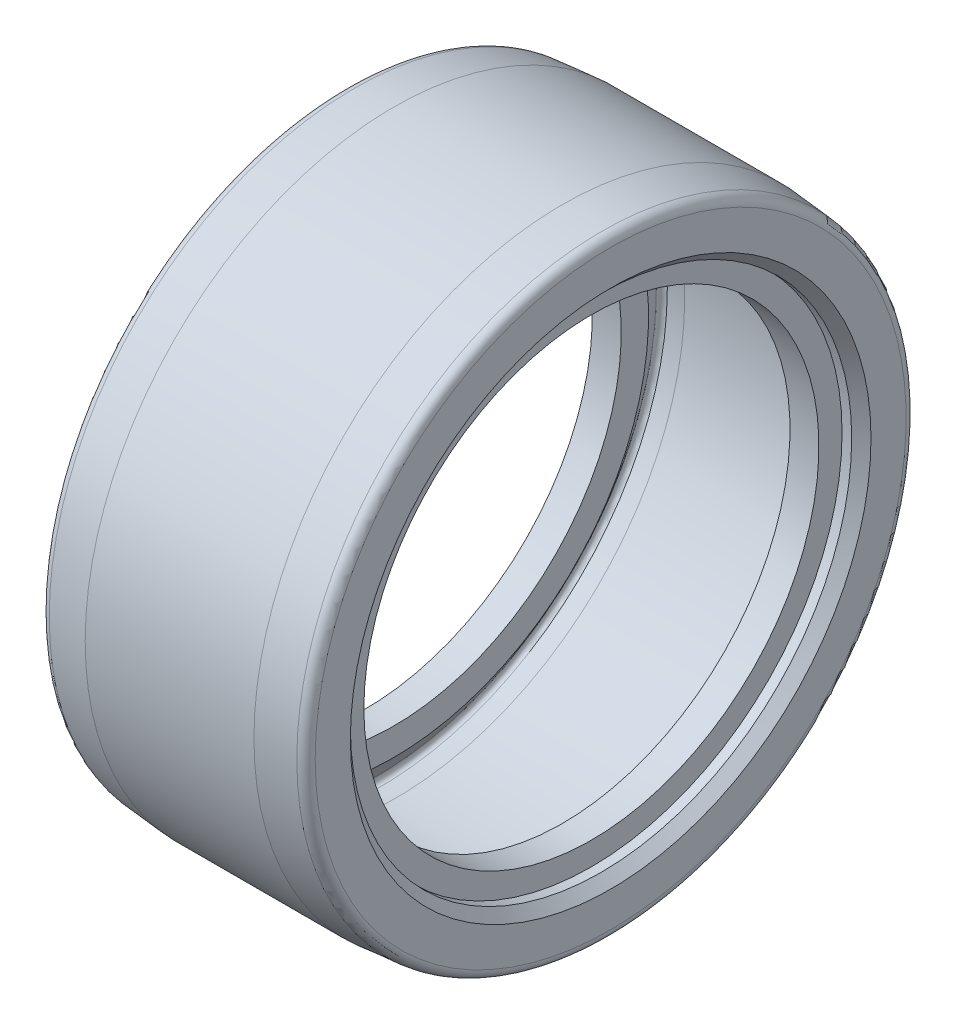
ISO-10303-21;
HEADER;
FILE_DESCRIPTION(('STEP AP214'),'2;1');
FILE_NAME('part.step','',(''),(''),'','','');
FILE_SCHEMA(('AUTOMOTIVE_DESIGN { 1 0 10303 214 1 1 1 1 }'));
ENDSEC;
DATA;
#1=APPLICATION_CONTEXT('core data for automotive mechanical design processes');
#2=APPLICATION_PROTOCOL_DEFINITION('international standard','automotive_design',2000,#1);
#3=PRODUCT_CONTEXT('',#1,'mechanical');
#4=PRODUCT('Part','Part','',(#3));
#5=PRODUCT_RELATED_PRODUCT_CATEGORY('part','',(#4));
#6=PRODUCT_DEFINITION_FORMATION('','',#4);
#7=PRODUCT_DEFINITION_CONTEXT('part definition',#1,'design');
#8=PRODUCT_DEFINITION('design','',#6,#7);
#9=PRODUCT_DEFINITION_SHAPE('','',#8);
#10=(LENGTH_UNIT() NAMED_UNIT(*) SI_UNIT(.MILLI.,.METRE.));
#11=(NAMED_UNIT(*) PLANE_ANGLE_UNIT() SI_UNIT($,.RADIAN.));
#12=(NAMED_UNIT(*) SI_UNIT($,.STERADIAN.) SOLID_ANGLE_UNIT());
#13=UNCERTAINTY_MEASURE_WITH_UNIT(LENGTH_MEASURE(1.E-05),#10,'distance_accuracy_value','');
#14=(GEOMETRIC_REPRESENTATION_CONTEXT(3) GLOBAL_UNCERTAINTY_ASSIGNED_CONTEXT((#13)) GLOBAL_UNIT_ASSIGNED_CONTEXT((#10,
#11,#12)) REPRESENTATION_CONTEXT('',''));
#15=CARTESIAN_POINT('',(0.,0.,0.));
#16=DIRECTION('',(0.,0.,1.));
#17=DIRECTION('',(1.,0.,0.));
#18=AXIS2_PLACEMENT_3D('',#15,#16,#17);
#19=CARTESIAN_POINT('',(2.5,23.6,0.));
#20=DIRECTION('',(-1.,0.,0.));
#21=DIRECTION('',(0.,0.,1.));
#22=AXIS2_PLACEMENT_3D('',#19,#20,#21);
#23=PLANE('',#22);
#24=CARTESIAN_POINT('',(2.5,0.,0.));
#25=DIRECTION('',(-1.,0.,0.));
#26=DIRECTION('',(0.,0.,1.));
#27=AXIS2_PLACEMENT_3D('',#24,#25,#26);
#28=CIRCLE('',#27,26.4296299831447);
#29=CARTESIAN_POINT('',(2.5,0.,26.4296299831447));
#30=VERTEX_POINT('',#29);
#31=EDGE_CURVE('E10',#30,#30,#28,.T.);
#32=ORIENTED_EDGE('',*,*,#31,.F.);
#33=EDGE_LOOP('',(#32));
#34=FACE_BOUND('',#33,.T.);
#35=CARTESIAN_POINT('',(2.5,0.,0.));
#36=DIRECTION('',(-1.,0.,0.));
#37=DIRECTION('',(0.,0.,1.));
#38=AXIS2_PLACEMENT_3D('',#35,#36,#37);
#39=CIRCLE('',#38,23.6);
#40=CARTESIAN_POINT('',(2.5,0.,23.6));
#41=VERTEX_POINT('',#40);
#42=EDGE_CURVE('E105',#41,#41,#39,.T.);
#43=ORIENTED_EDGE('',*,*,#42,.T.);
#44=EDGE_LOOP('',(#43));
#45=FACE_BOUND('',#44,.T.);
#46=ADVANCED_FACE('F29',(#34,#45),#23,.F.);
#47=CARTESIAN_POINT('',(2.5,0.,0.));
#48=DIRECTION('',(-1.,0.,0.));
#49=DIRECTION('',(0.,0.,1.));
#50=AXIS2_PLACEMENT_3D('',#47,#48,#49);
#51=CONICAL_SURFACE('',#50,26.4296299831447,0.959931088596876);
#52=CARTESIAN_POINT('',(0.646082422831486,0.,0.));
#53=DIRECTION('',(-1.,0.,0.));
#54=DIRECTION('',(0.,0.,1.));
#55=AXIS2_PLACEMENT_3D('',#52,#53,#54);
#56=CIRCLE('',#55,29.0772986756421);
#57=CARTESIAN_POINT('',(0.646082422831486,0.,29.0772986756421));
#58=VERTEX_POINT('',#57);
#59=EDGE_CURVE('E35',#58,#58,#56,.T.);
#60=ORIENTED_EDGE('',*,*,#59,.F.);
#61=EDGE_LOOP('',(#60));
#62=FACE_BOUND('',#61,.T.);
#63=ORIENTED_EDGE('',*,*,#31,.T.);
#64=EDGE_LOOP('',(#63));
#65=FACE_BOUND('',#64,.T.);
#66=ADVANCED_FACE('F238',(#62,#65),#51,.T.);
#67=CARTESIAN_POINT('',(1.05565844497598,0.,0.));
#68=DIRECTION('',(-1.,0.,0.));
#69=DIRECTION('',(0.,0.,1.));
#70=AXIS2_PLACEMENT_3D('',#67,#68,#69);
#71=TOROIDAL_SURFACE('',#70,29.3640868938176,0.5);
#72=CARTESIAN_POINT('',(1.01208057360216,0.,0.));
#73=DIRECTION('',(-1.,0.,0.));
#74=DIRECTION('',(0.,0.,1.));
#75=AXIS2_PLACEMENT_3D('',#72,#73,#74);
#76=CIRCLE('',#75,29.8621842428635);
#77=CARTESIAN_POINT('',(1.01208057360216,0.,29.8621842428635));
#78=VERTEX_POINT('',#77);
#79=EDGE_CURVE('E39',#78,#78,#76,.T.);
#80=ORIENTED_EDGE('',*,*,#79,.F.);
#81=EDGE_LOOP('',(#80));
#82=FACE_BOUND('',#81,.T.);
#83=ORIENTED_EDGE('',*,*,#59,.T.);
#84=EDGE_LOOP('',(#83));
#85=FACE_BOUND('',#84,.T.);
#86=ADVANCED_FACE('F233',(#82,#85),#71,.F.);
#87=CARTESIAN_POINT('',(1.01208057360216,0.,0.));
#88=DIRECTION('',(1.,0.,0.));
#89=DIRECTION('',(0.,0.,-1.));
#90=AXIS2_PLACEMENT_3D('',#87,#88,#89);
#91=CONICAL_SURFACE('',#90,29.8621842428635,0.0872664625997093);
#92=CARTESIAN_POINT('',(2.6743114854953,0.,0.));
#93=DIRECTION('',(-1.,0.,0.));
#94=DIRECTION('',(0.,0.,1.));
#95=AXIS2_PLACEMENT_3D('',#92,#93,#94);
#96=CIRCLE('',#95,30.0076106038165);
#97=CARTESIAN_POINT('',(2.6743114854953,0.,30.0076106038165));
#98=VERTEX_POINT('',#97);
#99=EDGE_CURVE('E43',#98,#98,#96,.T.);
#100=ORIENTED_EDGE('',*,*,#99,.F.);
#101=EDGE_LOOP('',(#100));
#102=FACE_BOUND('',#101,.T.);
#103=ORIENTED_EDGE('',*,*,#79,.T.);
#104=EDGE_LOOP('',(#103));
#105=FACE_BOUND('',#104,.T.);
#106=ADVANCED_FACE('F227',(#102,#105),#91,.F.);
#107=CARTESIAN_POINT('',(10.,0.,0.));
#108=DIRECTION('',(-1.,0.,0.));
#109=DIRECTION('',(0.,0.,1.));
#110=AXIS2_PLACEMENT_3D('',#107,#108,#109);
#111=CYLINDRICAL_SURFACE('',#110,30.0076106038165);
#112=CARTESIAN_POINT('',(19.8256885145047,0.,0.));
#113=DIRECTION('',(-1.,0.,0.));
#114=DIRECTION('',(0.,0.,1.));
#115=AXIS2_PLACEMENT_3D('',#112,#113,#114);
#116=CIRCLE('',#115,30.0076106038165);
#117=CARTESIAN_POINT('',(19.8256885145047,0.,30.0076106038165));
#118=VERTEX_POINT('',#117);
#119=EDGE_CURVE('E48',#118,#118,#116,.T.);
#120=ORIENTED_EDGE('',*,*,#119,.F.);
#121=EDGE_LOOP('',(#120));
#122=FACE_BOUND('',#121,.T.);
#123=ORIENTED_EDGE('',*,*,#99,.T.);
#124=EDGE_LOOP('',(#123));
#125=FACE_BOUND('',#124,.T.);
#126=ADVANCED_FACE('F221',(#122,#125),#111,.F.);
#127=CARTESIAN_POINT('',(19.8256885145047,0.,0.));
#128=DIRECTION('',(-1.,0.,0.));
#129=DIRECTION('',(0.,0.,1.));
#130=AXIS2_PLACEMENT_3D('',#127,#128,#129);
#131=CONICAL_SURFACE('',#130,30.0076106038165,0.0872664625997073);
#132=CARTESIAN_POINT('',(21.4879194263978,0.,0.));
#133=DIRECTION('',(-1.,0.,0.));
#134=DIRECTION('',(0.,0.,1.));
#135=AXIS2_PLACEMENT_3D('',#132,#133,#134);
#136=CIRCLE('',#135,29.8621842428635);
#137=CARTESIAN_POINT('',(21.4879194263978,0.,29.8621842428635));
#138=VERTEX_POINT('',#137);
#139=EDGE_CURVE('E51',#138,#138,#136,.T.);
#140=ORIENTED_EDGE('',*,*,#139,.F.);
#141=EDGE_LOOP('',(#140));
#142=FACE_BOUND('',#141,.T.);
#143=ORIENTED_EDGE('',*,*,#119,.T.);
#144=EDGE_LOOP('',(#143));
#145=FACE_BOUND('',#144,.T.);
#146=ADVANCED_FACE('F215',(#142,#145),#131,.F.);
#147=CARTESIAN_POINT('',(21.444341555024,0.,0.));
#148=DIRECTION('',(-1.,0.,0.));
#149=DIRECTION('',(0.,0.,1.));
#150=AXIS2_PLACEMENT_3D('',#147,#148,#149);
#151=TOROIDAL_SURFACE('',#150,29.3640868938176,0.500000000000002);
#152=CARTESIAN_POINT('',(21.8539175771685,0.,0.));
#153=DIRECTION('',(-1.,0.,0.));
#154=DIRECTION('',(0.,0.,1.));
#155=AXIS2_PLACEMENT_3D('',#152,#153,#154);
#156=CIRCLE('',#155,29.0772986756421);
#157=CARTESIAN_POINT('',(21.8539175771685,0.,29.0772986756421));
#158=VERTEX_POINT('',#157);
#159=EDGE_CURVE('E54',#158,#158,#156,.T.);
#160=ORIENTED_EDGE('',*,*,#159,.F.);
#161=EDGE_LOOP('',(#160));
#162=FACE_BOUND('',#161,.T.);
#163=ORIENTED_EDGE('',*,*,#139,.T.);
#164=EDGE_LOOP('',(#163));
#165=FACE_BOUND('',#164,.T.);
#166=ADVANCED_FACE('F209',(#162,#165),#151,.F.);
#167=CARTESIAN_POINT('',(21.8539175771685,0.,0.));
#168=DIRECTION('',(1.,0.,0.));
#169=DIRECTION('',(0.,0.,-1.));
#170=AXIS2_PLACEMENT_3D('',#167,#168,#169);
#171=CONICAL_SURFACE('',#170,29.0772986756421,0.959931088596874);
#172=CARTESIAN_POINT('',(20.,0.,0.));
#173=DIRECTION('',(-1.,0.,0.));
#174=DIRECTION('',(0.,0.,1.));
#175=AXIS2_PLACEMENT_3D('',#172,#173,#174);
#176=CIRCLE('',#175,26.4296299831448);
#177=CARTESIAN_POINT('',(20.,0.,26.4296299831448));
#178=VERTEX_POINT('',#177);
#179=EDGE_CURVE('E57',#178,#178,#176,.T.);
#180=ORIENTED_EDGE('',*,*,#179,.F.);
#181=EDGE_LOOP('',(#180));
#182=FACE_BOUND('',#181,.T.);
#183=ORIENTED_EDGE('',*,*,#159,.T.);
#184=EDGE_LOOP('',(#183));
#185=FACE_BOUND('',#184,.T.);
#186=ADVANCED_FACE('F203',(#182,#185),#171,.T.);
#187=CARTESIAN_POINT('',(20.,23.6,0.));
#188=DIRECTION('',(1.,0.,0.));
#189=DIRECTION('',(0.,0.,-1.));
#190=AXIS2_PLACEMENT_3D('',#187,#188,#189);
#191=PLANE('',#190);
#192=CARTESIAN_POINT('',(20.,0.,0.));
#193=DIRECTION('',(-1.,0.,0.));
#194=DIRECTION('',(0.,0.,1.));
#195=AXIS2_PLACEMENT_3D('',#192,#193,#194);
#196=CIRCLE('',#195,23.6);
#197=CARTESIAN_POINT('',(20.,0.,23.6));
#198=VERTEX_POINT('',#197);
#199=EDGE_CURVE('E60',#198,#198,#196,.T.);
#200=ORIENTED_EDGE('',*,*,#199,.F.);
#201=EDGE_LOOP('',(#200));
#202=FACE_BOUND('',#201,.T.);
#203=ORIENTED_EDGE('',*,*,#179,.T.);
#204=EDGE_LOOP('',(#203));
#205=FACE_BOUND('',#204,.T.);
#206=ADVANCED_FACE('F197',(#202,#205),#191,.F.);
#207=CARTESIAN_POINT('',(10.,0.,0.));
#208=DIRECTION('',(-1.,0.,0.));
#209=DIRECTION('',(0.,0.,1.));
#210=AXIS2_PLACEMENT_3D('',#207,#208,#209);
#211=CYLINDRICAL_SURFACE('',#210,23.6);
#212=CARTESIAN_POINT('',(23.,0.,0.));
#213=DIRECTION('',(-1.,0.,0.));
#214=DIRECTION('',(0.,0.,1.));
#215=AXIS2_PLACEMENT_3D('',#212,#213,#214);
#216=CIRCLE('',#215,23.6);
#217=CARTESIAN_POINT('',(23.,0.,23.6));
#218=VERTEX_POINT('',#217);
#219=EDGE_CURVE('E63',#218,#218,#216,.T.);
#220=ORIENTED_EDGE('',*,*,#219,.F.);
#221=EDGE_LOOP('',(#220));
#222=FACE_BOUND('',#221,.T.);
#223=ORIENTED_EDGE('',*,*,#199,.T.);
#224=EDGE_LOOP('',(#223));
#225=FACE_BOUND('',#224,.T.);
#226=ADVANCED_FACE('F191',(#222,#225),#211,.F.);
#227=CARTESIAN_POINT('',(23.,23.6,0.));
#228=DIRECTION('',(-1.,0.,0.));
#229=DIRECTION('',(0.,0.,1.));
#230=AXIS2_PLACEMENT_3D('',#227,#228,#229);
#231=PLANE('',#230);
#232=CARTESIAN_POINT('',(23.,0.,0.));
#233=DIRECTION('',(-1.,0.,0.));
#234=DIRECTION('',(0.,0.,1.));
#235=AXIS2_PLACEMENT_3D('',#232,#233,#234);
#236=CIRCLE('',#235,26.);
#237=CARTESIAN_POINT('',(23.,0.,26.));
#238=VERTEX_POINT('',#237);
#239=EDGE_CURVE('E66',#238,#238,#236,.T.);
#240=ORIENTED_EDGE('',*,*,#239,.F.);
#241=EDGE_LOOP('',(#240));
#242=FACE_BOUND('',#241,.T.);
#243=ORIENTED_EDGE('',*,*,#219,.T.);
#244=EDGE_LOOP('',(#243));
#245=FACE_BOUND('',#244,.T.);
#246=ADVANCED_FACE('F185',(#242,#245),#231,.F.);
#247=CARTESIAN_POINT('',(10.,0.,0.));
#248=DIRECTION('',(-1.,0.,0.));
#249=DIRECTION('',(0.,0.,1.));
#250=AXIS2_PLACEMENT_3D('',#247,#248,#249);
#251=CYLINDRICAL_SURFACE('',#250,26.);
#252=CARTESIAN_POINT('',(24.,0.,0.));
#253=DIRECTION('',(-1.,0.,0.));
#254=DIRECTION('',(0.,0.,1.));
#255=AXIS2_PLACEMENT_3D('',#252,#253,#254);
#256=CIRCLE('',#255,26.);
#257=CARTESIAN_POINT('',(24.,0.,26.));
#258=VERTEX_POINT('',#257);
#259=EDGE_CURVE('E69',#258,#258,#256,.T.);
#260=ORIENTED_EDGE('',*,*,#259,.F.);
#261=EDGE_LOOP('',(#260));
#262=FACE_BOUND('',#261,.T.);
#263=ORIENTED_EDGE('',*,*,#239,.T.);
#264=EDGE_LOOP('',(#263));
#265=FACE_BOUND('',#264,.T.);
#266=ADVANCED_FACE('F179',(#262,#265),#251,.F.);
#267=CARTESIAN_POINT('',(24.,0.,0.));
#268=DIRECTION('',(1.,0.,0.));
#269=DIRECTION('',(0.,0.,-1.));
#270=AXIS2_PLACEMENT_3D('',#267,#268,#269);
#271=CONICAL_SURFACE('',#270,26.,0.785398163397448);
#272=CARTESIAN_POINT('',(25.,0.,0.));
#273=DIRECTION('',(-1.,0.,0.));
#274=DIRECTION('',(0.,0.,1.));
#275=AXIS2_PLACEMENT_3D('',#272,#273,#274);
#276=CIRCLE('',#275,27.);
#277=CARTESIAN_POINT('',(25.,0.,27.));
#278=VERTEX_POINT('',#277);
#279=EDGE_CURVE('E72',#278,#278,#276,.T.);
#280=ORIENTED_EDGE('',*,*,#279,.F.);
#281=EDGE_LOOP('',(#280));
#282=FACE_BOUND('',#281,.T.);
#283=ORIENTED_EDGE('',*,*,#259,.T.);
#284=EDGE_LOOP('',(#283));
#285=FACE_BOUND('',#284,.T.);
#286=ADVANCED_FACE('F173',(#282,#285),#271,.F.);
#287=CARTESIAN_POINT('',(25.,30.646225508353,0.));
#288=DIRECTION('',(-1.,0.,0.));
#289=DIRECTION('',(0.,0.,1.));
#290=AXIS2_PLACEMENT_3D('',#287,#288,#289);
#291=PLANE('',#290);
#292=CARTESIAN_POINT('',(25.,0.,0.));
#293=DIRECTION('',(-1.,0.,0.));
#294=DIRECTION('',(0.,0.,1.));
#295=AXIS2_PLACEMENT_3D('',#292,#293,#294);
#296=CIRCLE('',#295,30.646225508353);
#297=CARTESIAN_POINT('',(25.,0.,30.646225508353));
#298=VERTEX_POINT('',#297);
#299=EDGE_CURVE('E75',#298,#298,#296,.T.);
#300=ORIENTED_EDGE('',*,*,#299,.F.);
#301=EDGE_LOOP('',(#300));
#302=FACE_BOUND('',#301,.T.);
#303=ORIENTED_EDGE('',*,*,#279,.T.);
#304=EDGE_LOOP('',(#303));
#305=FACE_BOUND('',#304,.T.);
#306=ADVANCED_FACE('F167',(#302,#305),#291,.F.);
#307=CARTESIAN_POINT('',(24.,0.,0.));
#308=DIRECTION('',(-1.,0.,0.));
#309=DIRECTION('',(0.,0.,1.));
#310=AXIS2_PLACEMENT_3D('',#307,#308,#309);
#311=TOROIDAL_SURFACE('',#310,30.646225508353,1.);
#312=CARTESIAN_POINT('',(24.0871557427476,0.,0.));
#313=DIRECTION('',(-1.,0.,0.));
#314=DIRECTION('',(0.,0.,1.));
#315=AXIS2_PLACEMENT_3D('',#312,#313,#314);
#316=CIRCLE('',#315,31.6424202064447);
#317=CARTESIAN_POINT('',(24.0871557427476,0.,31.6424202064447));
#318=VERTEX_POINT('',#317);
#319=EDGE_CURVE('E78',#318,#318,#316,.T.);
#320=ORIENTED_EDGE('',*,*,#319,.F.);
#321=EDGE_LOOP('',(#320));
#322=FACE_BOUND('',#321,.T.);
#323=ORIENTED_EDGE('',*,*,#299,.T.);
#324=EDGE_LOOP('',(#323));
#325=FACE_BOUND('',#324,.T.);
#326=ADVANCED_FACE('F161',(#322,#325),#311,.T.);
#327=CARTESIAN_POINT('',(24.0871557427476,0.,0.));
#328=DIRECTION('',(-1.,0.,0.));
#329=DIRECTION('',(0.,0.,1.));
#330=AXIS2_PLACEMENT_3D('',#327,#328,#329);
#331=CONICAL_SURFACE('',#330,31.6424202064447,0.0872664625997093);
#332=CARTESIAN_POINT('',(20.,0.,0.));
#333=DIRECTION('',(-1.,0.,0.));
#334=DIRECTION('',(0.,0.,1.));
#335=AXIS2_PLACEMENT_3D('',#332,#333,#334);
#336=CIRCLE('',#335,32.);
#337=CARTESIAN_POINT('',(20.,0.,32.));
#338=VERTEX_POINT('',#337);
#339=EDGE_CURVE('E81',#338,#338,#336,.T.);
#340=ORIENTED_EDGE('',*,*,#339,.F.);
#341=EDGE_LOOP('',(#340));
#342=FACE_BOUND('',#341,.T.);
#343=ORIENTED_EDGE('',*,*,#319,.T.);
#344=EDGE_LOOP('',(#343));
#345=FACE_BOUND('',#344,.T.);
#346=ADVANCED_FACE('F155',(#342,#345),#331,.T.);
#347=CARTESIAN_POINT('',(10.,0.,0.));
#348=DIRECTION('',(-1.,0.,0.));
#349=DIRECTION('',(0.,0.,1.));
#350=AXIS2_PLACEMENT_3D('',#347,#348,#349);
#351=CYLINDRICAL_SURFACE('',#350,32.);
#352=CARTESIAN_POINT('',(2.5,0.,0.));
#353=DIRECTION('',(-1.,0.,0.));
#354=DIRECTION('',(0.,0.,1.));
#355=AXIS2_PLACEMENT_3D('',#352,#353,#354);
#356=CIRCLE('',#355,32.);
#357=CARTESIAN_POINT('',(2.5,0.,32.));
#358=VERTEX_POINT('',#357);
#359=EDGE_CURVE('E84',#358,#358,#356,.T.);
#360=ORIENTED_EDGE('',*,*,#359,.F.);
#361=EDGE_LOOP('',(#360));
#362=FACE_BOUND('',#361,.T.);
#363=ORIENTED_EDGE('',*,*,#339,.T.);
#364=EDGE_LOOP('',(#363));
#365=FACE_BOUND('',#364,.T.);
#366=ADVANCED_FACE('F149',(#362,#365),#351,.T.);
#367=CARTESIAN_POINT('',(2.5,0.,0.));
#368=DIRECTION('',(1.,0.,0.));
#369=DIRECTION('',(0.,0.,-1.));
#370=AXIS2_PLACEMENT_3D('',#367,#368,#369);
#371=CONICAL_SURFACE('',#370,32.,0.0872664625997092);
#372=CARTESIAN_POINT('',(-1.58715574274764,0.,0.));
#373=DIRECTION('',(-1.,0.,0.));
#374=DIRECTION('',(0.,0.,1.));
#375=AXIS2_PLACEMENT_3D('',#372,#373,#374);
#376=CIRCLE('',#375,31.6424202064447);
#377=CARTESIAN_POINT('',(-1.58715574274764,0.,31.6424202064447));
#378=VERTEX_POINT('',#377);
#379=EDGE_CURVE('E87',#378,#378,#376,.T.);
#380=ORIENTED_EDGE('',*,*,#379,.F.);
#381=EDGE_LOOP('',(#380));
#382=FACE_BOUND('',#381,.T.);
#383=ORIENTED_EDGE('',*,*,#359,.T.);
#384=EDGE_LOOP('',(#383));
#385=FACE_BOUND('',#384,.T.);
#386=ADVANCED_FACE('F143',(#382,#385),#371,.T.);
#387=CARTESIAN_POINT('',(-1.5,0.,0.));
#388=DIRECTION('',(-1.,0.,0.));
#389=DIRECTION('',(0.,0.,1.));
#390=AXIS2_PLACEMENT_3D('',#387,#388,#389);
#391=TOROIDAL_SURFACE('',#390,30.646225508353,1.);
#392=CARTESIAN_POINT('',(-2.5,0.,0.));
#393=DIRECTION('',(-1.,0.,0.));
#394=DIRECTION('',(0.,0.,1.));
#395=AXIS2_PLACEMENT_3D('',#392,#393,#394);
#396=CIRCLE('',#395,30.646225508353);
#397=CARTESIAN_POINT('',(-2.5,0.,30.646225508353));
#398=VERTEX_POINT('',#397);
#399=EDGE_CURVE('E90',#398,#398,#396,.T.);
#400=ORIENTED_EDGE('',*,*,#399,.F.);
#401=EDGE_LOOP('',(#400));
#402=FACE_BOUND('',#401,.T.);
#403=ORIENTED_EDGE('',*,*,#379,.T.);
#404=EDGE_LOOP('',(#403));
#405=FACE_BOUND('',#404,.T.);
#406=ADVANCED_FACE('F137',(#402,#405),#391,.T.);
#407=CARTESIAN_POINT('',(-2.5,30.646225508353,0.));
#408=DIRECTION('',(1.,0.,0.));
#409=DIRECTION('',(0.,0.,-1.));
#410=AXIS2_PLACEMENT_3D('',#407,#408,#409);
#411=PLANE('',#410);
#412=CARTESIAN_POINT('',(-2.5,0.,0.));
#413=DIRECTION('',(-1.,0.,0.));
#414=DIRECTION('',(0.,0.,1.));
#415=AXIS2_PLACEMENT_3D('',#412,#413,#414);
#416=CIRCLE('',#415,27.);
#417=CARTESIAN_POINT('',(-2.5,0.,27.));
#418=VERTEX_POINT('',#417);
#419=EDGE_CURVE('E93',#418,#418,#416,.T.);
#420=ORIENTED_EDGE('',*,*,#419,.F.);
#421=EDGE_LOOP('',(#420));
#422=FACE_BOUND('',#421,.T.);
#423=ORIENTED_EDGE('',*,*,#399,.T.);
#424=EDGE_LOOP('',(#423));
#425=FACE_BOUND('',#424,.T.);
#426=ADVANCED_FACE('F131',(#422,#425),#411,.F.);
#427=CARTESIAN_POINT('',(-2.5,0.,0.));
#428=DIRECTION('',(-1.,0.,0.));
#429=DIRECTION('',(0.,0.,1.));
#430=AXIS2_PLACEMENT_3D('',#427,#428,#429);
#431=CONICAL_SURFACE('',#430,27.,0.785398163397449);
#432=CARTESIAN_POINT('',(-1.5,0.,0.));
#433=DIRECTION('',(-1.,0.,0.));
#434=DIRECTION('',(0.,0.,1.));
#435=AXIS2_PLACEMENT_3D('',#432,#433,#434);
#436=CIRCLE('',#435,26.);
#437=CARTESIAN_POINT('',(-1.5,0.,26.));
#438=VERTEX_POINT('',#437);
#439=EDGE_CURVE('E96',#438,#438,#436,.T.);
#440=ORIENTED_EDGE('',*,*,#439,.F.);
#441=EDGE_LOOP('',(#440));
#442=FACE_BOUND('',#441,.T.);
#443=ORIENTED_EDGE('',*,*,#419,.T.);
#444=EDGE_LOOP('',(#443));
#445=FACE_BOUND('',#444,.T.);
#446=ADVANCED_FACE('F125',(#442,#445),#431,.F.);
#447=CARTESIAN_POINT('',(10.,0.,0.));
#448=DIRECTION('',(-1.,0.,0.));
#449=DIRECTION('',(0.,0.,1.));
#450=AXIS2_PLACEMENT_3D('',#447,#448,#449);
#451=CYLINDRICAL_SURFACE('',#450,26.);
#452=CARTESIAN_POINT('',(-0.5,0.,0.));
#453=DIRECTION('',(-1.,0.,0.));
#454=DIRECTION('',(0.,0.,1.));
#455=AXIS2_PLACEMENT_3D('',#452,#453,#454);
#456=CIRCLE('',#455,26.);
#457=CARTESIAN_POINT('',(-0.5,0.,26.));
#458=VERTEX_POINT('',#457);
#459=EDGE_CURVE('E99',#458,#458,#456,.T.);
#460=ORIENTED_EDGE('',*,*,#459,.F.);
#461=EDGE_LOOP('',(#460));
#462=FACE_BOUND('',#461,.T.);
#463=ORIENTED_EDGE('',*,*,#439,.T.);
#464=EDGE_LOOP('',(#463));
#465=FACE_BOUND('',#464,.T.);
#466=ADVANCED_FACE('F119',(#462,#465),#451,.F.);
#467=CARTESIAN_POINT('',(-0.500000000000001,23.6,0.));
#468=DIRECTION('',(1.,0.,0.));
#469=DIRECTION('',(0.,0.,-1.));
#470=AXIS2_PLACEMENT_3D('',#467,#468,#469);
#471=PLANE('',#470);
#472=CARTESIAN_POINT('',(-0.5,0.,0.));
#473=DIRECTION('',(-1.,0.,0.));
#474=DIRECTION('',(0.,0.,1.));
#475=AXIS2_PLACEMENT_3D('',#472,#473,#474);
#476=CIRCLE('',#475,23.6);
#477=CARTESIAN_POINT('',(-0.5,0.,23.6));
#478=VERTEX_POINT('',#477);
#479=EDGE_CURVE('E102',#478,#478,#476,.T.);
#480=ORIENTED_EDGE('',*,*,#479,.F.);
#481=EDGE_LOOP('',(#480));
#482=FACE_BOUND('',#481,.T.);
#483=ORIENTED_EDGE('',*,*,#459,.T.);
#484=EDGE_LOOP('',(#483));
#485=FACE_BOUND('',#484,.T.);
#486=ADVANCED_FACE('F113',(#482,#485),#471,.F.);
#487=CARTESIAN_POINT('',(10.,0.,0.));
#488=DIRECTION('',(-1.,0.,0.));
#489=DIRECTION('',(0.,0.,1.));
#490=AXIS2_PLACEMENT_3D('',#487,#488,#489);
#491=CYLINDRICAL_SURFACE('',#490,23.6);
#492=ORIENTED_EDGE('',*,*,#42,.F.);
#493=EDGE_LOOP('',(#492));
#494=FACE_BOUND('',#493,.T.);
#495=ORIENTED_EDGE('',*,*,#479,.T.);
#496=EDGE_LOOP('',(#495));
#497=FACE_BOUND('',#496,.T.);
#498=ADVANCED_FACE('F110',(#494,#497),#491,.F.);
#499=CLOSED_SHELL('',(#46,#66,#86,#106,#126,#146,#166,#186,#206,#226,#246,#266,#286,#306,#326,
#346,#366,#386,#406,#426,#446,#466,#486,#498));
#500=MANIFOLD_SOLID_BREP('B2',#499);
#501=ADVANCED_BREP_SHAPE_REPRESENTATION('',(#18,#500),#14);
#502=SHAPE_DEFINITION_REPRESENTATION(#9,#501);
ENDSEC;
END-ISO-10303-21;
